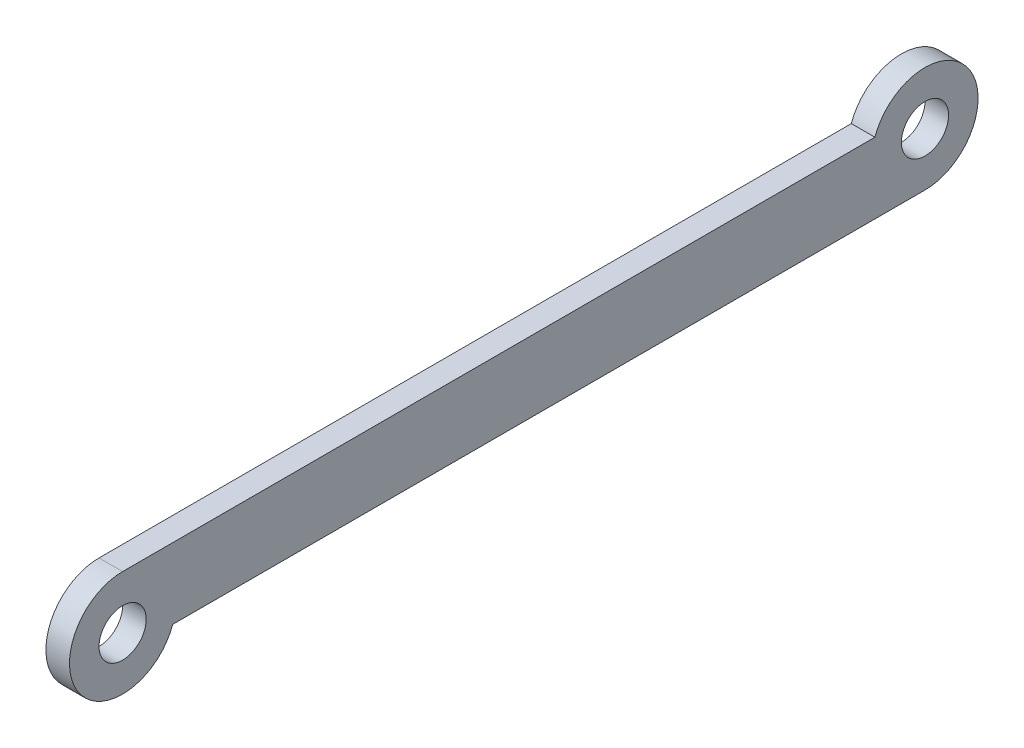
ISO-10303-21;
HEADER;
FILE_DESCRIPTION(('STEP AP214'),'2;1');
FILE_NAME('part.step','',(''),(''),'','','');
FILE_SCHEMA(('AUTOMOTIVE_DESIGN { 1 0 10303 214 1 1 1 1 }'));
ENDSEC;
DATA;
#1=APPLICATION_CONTEXT('core data for automotive mechanical design processes');
#2=APPLICATION_PROTOCOL_DEFINITION('international standard','automotive_design',2000,#1);
#3=PRODUCT_CONTEXT('',#1,'mechanical');
#4=PRODUCT('Part','Part','',(#3));
#5=PRODUCT_RELATED_PRODUCT_CATEGORY('part','',(#4));
#6=PRODUCT_DEFINITION_FORMATION('','',#4);
#7=PRODUCT_DEFINITION_CONTEXT('part definition',#1,'design');
#8=PRODUCT_DEFINITION('design','',#6,#7);
#9=PRODUCT_DEFINITION_SHAPE('','',#8);
#10=(LENGTH_UNIT() NAMED_UNIT(*) SI_UNIT(.MILLI.,.METRE.));
#11=(NAMED_UNIT(*) PLANE_ANGLE_UNIT() SI_UNIT($,.RADIAN.));
#12=(NAMED_UNIT(*) SI_UNIT($,.STERADIAN.) SOLID_ANGLE_UNIT());
#13=UNCERTAINTY_MEASURE_WITH_UNIT(LENGTH_MEASURE(1.E-05),#10,'distance_accuracy_value','');
#14=(GEOMETRIC_REPRESENTATION_CONTEXT(3) GLOBAL_UNCERTAINTY_ASSIGNED_CONTEXT((#13)) GLOBAL_UNIT_ASSIGNED_CONTEXT((#10,
#11,#12)) REPRESENTATION_CONTEXT('',''));
#15=CARTESIAN_POINT('',(0.,0.,0.));
#16=DIRECTION('',(0.,0.,1.));
#17=DIRECTION('',(1.,0.,0.));
#18=AXIS2_PLACEMENT_3D('',#15,#16,#17);
#19=CARTESIAN_POINT('',(0.,0.,0.));
#20=DIRECTION('',(1.,0.,0.));
#21=DIRECTION('',(0.,0.,-1.));
#22=AXIS2_PLACEMENT_3D('',#19,#20,#21);
#23=PLANE('',#22);
#24=CARTESIAN_POINT('',(0.,1.5,-32.));
#25=DIRECTION('',(1.,0.,0.));
#26=DIRECTION('',(0.,0.,-1.));
#27=AXIS2_PLACEMENT_3D('',#24,#25,#26);
#28=CIRCLE('',#27,2.25);
#29=CARTESIAN_POINT('',(0.,2.25,-29.8786796564404));
#30=VERTEX_POINT('',#29);
#31=CARTESIAN_POINT('',(0.,-0.750000000000001,-32.));
#32=VERTEX_POINT('',#31);
#33=EDGE_CURVE('E145',#30,#32,#28,.F.);
#34=ORIENTED_EDGE('',*,*,#33,.F.);
#35=DIRECTION('',(0.,0.,1.));
#36=VECTOR('',#35,1.);
#37=CARTESIAN_POINT('',(0.,2.25,0.));
#38=LINE('',#37,#36);
#39=CARTESIAN_POINT('',(0.,2.25,2.));
#40=VERTEX_POINT('',#39);
#41=EDGE_CURVE('E78',#40,#30,#38,.F.);
#42=ORIENTED_EDGE('',*,*,#41,.F.);
#43=CARTESIAN_POINT('',(0.,0.,2.));
#44=DIRECTION('',(1.,0.,0.));
#45=DIRECTION('',(0.,0.,-1.));
#46=AXIS2_PLACEMENT_3D('',#43,#44,#45);
#47=CIRCLE('',#46,2.25);
#48=CARTESIAN_POINT('',(0.,-0.750000000000004,-0.12132034355964));
#49=VERTEX_POINT('',#48);
#50=EDGE_CURVE('E141',#49,#40,#47,.F.);
#51=ORIENTED_EDGE('',*,*,#50,.F.);
#52=DIRECTION('',(0.,0.,-1.));
#53=VECTOR('',#52,1.);
#54=CARTESIAN_POINT('',(0.,-0.75,-32.));
#55=LINE('',#54,#53);
#56=EDGE_CURVE('E72',#32,#49,#55,.F.);
#57=ORIENTED_EDGE('',*,*,#56,.F.);
#58=EDGE_LOOP('',(#34,#42,#51,#57));
#59=FACE_BOUND('',#58,.T.);
#60=CARTESIAN_POINT('',(0.,0.,2.));
#61=DIRECTION('',(1.,0.,0.));
#62=DIRECTION('',(0.,0.,-1.));
#63=AXIS2_PLACEMENT_3D('',#60,#61,#62);
#64=CIRCLE('',#63,1.);
#65=CARTESIAN_POINT('',(0.,0.,0.999999999999999));
#66=VERTEX_POINT('',#65);
#67=EDGE_CURVE('E132',#66,#66,#64,.F.);
#68=ORIENTED_EDGE('',*,*,#67,.T.);
#69=EDGE_LOOP('',(#68));
#70=FACE_BOUND('',#69,.T.);
#71=CARTESIAN_POINT('',(0.,1.5,-32.));
#72=DIRECTION('',(1.,0.,0.));
#73=DIRECTION('',(0.,0.,-1.));
#74=AXIS2_PLACEMENT_3D('',#71,#72,#73);
#75=CIRCLE('',#74,1.);
#76=CARTESIAN_POINT('',(0.,1.5,-33.));
#77=VERTEX_POINT('',#76);
#78=EDGE_CURVE('E134',#77,#77,#75,.F.);
#79=ORIENTED_EDGE('',*,*,#78,.T.);
#80=EDGE_LOOP('',(#79));
#81=FACE_BOUND('',#80,.T.);
#82=ADVANCED_FACE('F37',(#59,#70,#81),#23,.T.);
#83=CARTESIAN_POINT('',(-1.,1.5,-32.));
#84=DIRECTION('',(1.,0.,0.));
#85=DIRECTION('',(0.,0.,-1.));
#86=AXIS2_PLACEMENT_3D('',#83,#84,#85);
#87=CYLINDRICAL_SURFACE('',#86,1.);
#88=CARTESIAN_POINT('',(-1.,1.5,-32.));
#89=DIRECTION('',(1.,0.,0.));
#90=DIRECTION('',(0.,0.,-1.));
#91=AXIS2_PLACEMENT_3D('',#88,#89,#90);
#92=CIRCLE('',#91,1.);
#93=CARTESIAN_POINT('',(-1.,1.5,-33.));
#94=VERTEX_POINT('',#93);
#95=EDGE_CURVE('E99',#94,#94,#92,.F.);
#96=ORIENTED_EDGE('',*,*,#95,.T.);
#97=EDGE_LOOP('',(#96));
#98=FACE_BOUND('',#97,.T.);
#99=ORIENTED_EDGE('',*,*,#78,.F.);
#100=EDGE_LOOP('',(#99));
#101=FACE_BOUND('',#100,.T.);
#102=ADVANCED_FACE('F117',(#98,#101),#87,.F.);
#103=CARTESIAN_POINT('',(-1.,0.,2.));
#104=DIRECTION('',(1.,0.,0.));
#105=DIRECTION('',(0.,0.,-1.));
#106=AXIS2_PLACEMENT_3D('',#103,#104,#105);
#107=CYLINDRICAL_SURFACE('',#106,1.);
#108=CARTESIAN_POINT('',(-1.,0.,2.));
#109=DIRECTION('',(1.,0.,0.));
#110=DIRECTION('',(0.,0.,-1.));
#111=AXIS2_PLACEMENT_3D('',#108,#109,#110);
#112=CIRCLE('',#111,1.);
#113=CARTESIAN_POINT('',(-1.,0.,0.999999999999999));
#114=VERTEX_POINT('',#113);
#115=EDGE_CURVE('E95',#114,#114,#112,.F.);
#116=ORIENTED_EDGE('',*,*,#115,.T.);
#117=EDGE_LOOP('',(#116));
#118=FACE_BOUND('',#117,.T.);
#119=ORIENTED_EDGE('',*,*,#67,.F.);
#120=EDGE_LOOP('',(#119));
#121=FACE_BOUND('',#120,.T.);
#122=ADVANCED_FACE('F116',(#118,#121),#107,.F.);
#123=CARTESIAN_POINT('',(-1.,-0.75,-32.));
#124=DIRECTION('',(0.,-1.,0.));
#125=DIRECTION('',(0.,0.,-1.));
#126=AXIS2_PLACEMENT_3D('',#123,#124,#125);
#127=PLANE('',#126);
#128=DIRECTION('',(0.,0.,-1.));
#129=VECTOR('',#128,1.);
#130=CARTESIAN_POINT('',(-1.,-0.750000000000004,0.));
#131=LINE('',#130,#129);
#132=CARTESIAN_POINT('',(-1.,-0.750000000000004,-0.121320343559642));
#133=VERTEX_POINT('',#132);
#134=CARTESIAN_POINT('',(-1.,-0.750000000000003,-32.));
#135=VERTEX_POINT('',#134);
#136=EDGE_CURVE('E89',#133,#135,#131,.T.);
#137=ORIENTED_EDGE('',*,*,#136,.T.);
#138=DIRECTION('',(1.,0.,0.));
#139=VECTOR('',#138,1.);
#140=CARTESIAN_POINT('',(-1.,-0.750000000000002,-32.));
#141=LINE('',#140,#139);
#142=EDGE_CURVE('E84',#32,#135,#141,.F.);
#143=ORIENTED_EDGE('',*,*,#142,.F.);
#144=ORIENTED_EDGE('',*,*,#56,.T.);
#145=DIRECTION('',(1.,0.,0.));
#146=VECTOR('',#145,1.);
#147=CARTESIAN_POINT('',(-1.,-0.750000000000004,-0.121320343559642));
#148=LINE('',#147,#146);
#149=EDGE_CURVE('E41',#133,#49,#148,.T.);
#150=ORIENTED_EDGE('',*,*,#149,.F.);
#151=EDGE_LOOP('',(#137,#143,#144,#150));
#152=FACE_BOUND('',#151,.T.);
#153=ADVANCED_FACE('F97',(#152),#127,.T.);
#154=CARTESIAN_POINT('',(-1.,1.5,-32.));
#155=DIRECTION('',(1.,0.,0.));
#156=DIRECTION('',(0.,0.,-1.));
#157=AXIS2_PLACEMENT_3D('',#154,#155,#156);
#158=CYLINDRICAL_SURFACE('',#157,2.25);
#159=DIRECTION('',(1.,0.,0.));
#160=VECTOR('',#159,1.);
#161=CARTESIAN_POINT('',(-1.,2.25,-29.8786796564404));
#162=LINE('',#161,#160);
#163=CARTESIAN_POINT('',(-1.,2.25,-29.8786796564404));
#164=VERTEX_POINT('',#163);
#165=EDGE_CURVE('E142',#30,#164,#162,.F.);
#166=ORIENTED_EDGE('',*,*,#165,.F.);
#167=ORIENTED_EDGE('',*,*,#33,.T.);
#168=ORIENTED_EDGE('',*,*,#142,.T.);
#169=CARTESIAN_POINT('',(-1.,1.5,-32.));
#170=DIRECTION('',(1.,0.,0.));
#171=DIRECTION('',(0.,0.,-1.));
#172=AXIS2_PLACEMENT_3D('',#169,#170,#171);
#173=CIRCLE('',#172,2.25);
#174=EDGE_CURVE('E94',#135,#164,#173,.T.);
#175=ORIENTED_EDGE('',*,*,#174,.T.);
#176=EDGE_LOOP('',(#166,#167,#168,#175));
#177=FACE_BOUND('',#176,.T.);
#178=ADVANCED_FACE('F107',(#177),#158,.T.);
#179=CARTESIAN_POINT('',(-1.,2.25,0.));
#180=DIRECTION('',(0.,1.,0.));
#181=DIRECTION('',(0.,0.,1.));
#182=AXIS2_PLACEMENT_3D('',#179,#180,#181);
#183=PLANE('',#182);
#184=DIRECTION('',(0.,0.,-1.));
#185=VECTOR('',#184,1.);
#186=CARTESIAN_POINT('',(-1.,2.25,0.));
#187=LINE('',#186,#185);
#188=CARTESIAN_POINT('',(-1.,2.25,2.));
#189=VERTEX_POINT('',#188);
#190=EDGE_CURVE('E47',#164,#189,#187,.F.);
#191=ORIENTED_EDGE('',*,*,#190,.T.);
#192=DIRECTION('',(1.,0.,0.));
#193=VECTOR('',#192,1.);
#194=CARTESIAN_POINT('',(-1.,2.25,2.));
#195=LINE('',#194,#193);
#196=EDGE_CURVE('E55',#40,#189,#195,.F.);
#197=ORIENTED_EDGE('',*,*,#196,.F.);
#198=ORIENTED_EDGE('',*,*,#41,.T.);
#199=ORIENTED_EDGE('',*,*,#165,.T.);
#200=EDGE_LOOP('',(#191,#197,#198,#199));
#201=FACE_BOUND('',#200,.T.);
#202=ADVANCED_FACE('F101',(#201),#183,.T.);
#203=CARTESIAN_POINT('',(-1.,0.,2.));
#204=DIRECTION('',(1.,0.,0.));
#205=DIRECTION('',(0.,0.,-1.));
#206=AXIS2_PLACEMENT_3D('',#203,#204,#205);
#207=CYLINDRICAL_SURFACE('',#206,2.25);
#208=CARTESIAN_POINT('',(-1.,0.,2.));
#209=DIRECTION('',(1.,0.,0.));
#210=DIRECTION('',(0.,0.,-1.));
#211=AXIS2_PLACEMENT_3D('',#208,#209,#210);
#212=CIRCLE('',#211,2.25);
#213=EDGE_CURVE('E12',#189,#133,#212,.T.);
#214=ORIENTED_EDGE('',*,*,#213,.T.);
#215=ORIENTED_EDGE('',*,*,#149,.T.);
#216=ORIENTED_EDGE('',*,*,#50,.T.);
#217=ORIENTED_EDGE('',*,*,#196,.T.);
#218=EDGE_LOOP('',(#214,#215,#216,#217));
#219=FACE_BOUND('',#218,.T.);
#220=ADVANCED_FACE('F39',(#219),#207,.T.);
#221=CARTESIAN_POINT('',(-1.,0.,0.));
#222=DIRECTION('',(1.,0.,0.));
#223=DIRECTION('',(0.,0.,-1.));
#224=AXIS2_PLACEMENT_3D('',#221,#222,#223);
#225=PLANE('',#224);
#226=ORIENTED_EDGE('',*,*,#190,.F.);
#227=ORIENTED_EDGE('',*,*,#174,.F.);
#228=ORIENTED_EDGE('',*,*,#136,.F.);
#229=ORIENTED_EDGE('',*,*,#213,.F.);
#230=EDGE_LOOP('',(#226,#227,#228,#229));
#231=FACE_BOUND('',#230,.T.);
#232=ORIENTED_EDGE('',*,*,#115,.F.);
#233=EDGE_LOOP('',(#232));
#234=FACE_BOUND('',#233,.T.);
#235=ORIENTED_EDGE('',*,*,#95,.F.);
#236=EDGE_LOOP('',(#235));
#237=FACE_BOUND('',#236,.T.);
#238=ADVANCED_FACE('F91',(#231,#234,#237),#225,.F.);
#239=CLOSED_SHELL('',(#82,#102,#122,#153,#178,#202,#220,#238));
#240=MANIFOLD_SOLID_BREP('B2',#239);
#241=ADVANCED_BREP_SHAPE_REPRESENTATION('',(#18,#240),#14);
#242=SHAPE_DEFINITION_REPRESENTATION(#9,#241);
ENDSEC;
END-ISO-10303-21;
